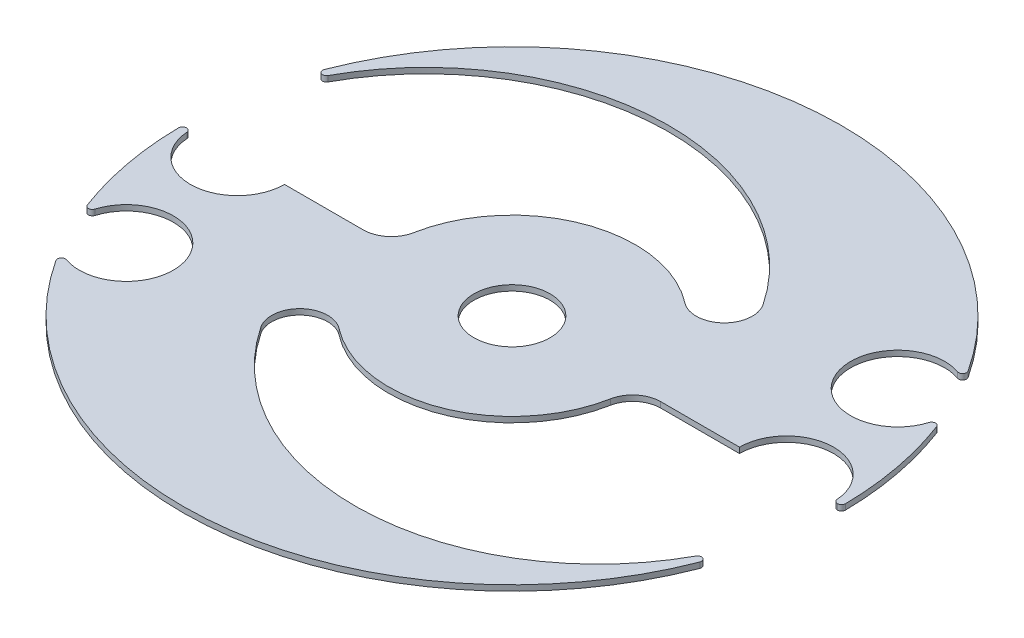
ISO-10303-21;
HEADER;
FILE_DESCRIPTION(('STEP AP214'),'2;1');
FILE_NAME('part.step','',(''),(''),'','','');
FILE_SCHEMA(('AUTOMOTIVE_DESIGN { 1 0 10303 214 1 1 1 1 }'));
ENDSEC;
DATA;
#1=APPLICATION_CONTEXT('core data for automotive mechanical design processes');
#2=APPLICATION_PROTOCOL_DEFINITION('international standard','automotive_design',2000,#1);
#3=PRODUCT_CONTEXT('',#1,'mechanical');
#4=PRODUCT('Part','Part','',(#3));
#5=PRODUCT_RELATED_PRODUCT_CATEGORY('part','',(#4));
#6=PRODUCT_DEFINITION_FORMATION('','',#4);
#7=PRODUCT_DEFINITION_CONTEXT('part definition',#1,'design');
#8=PRODUCT_DEFINITION('design','',#6,#7);
#9=PRODUCT_DEFINITION_SHAPE('','',#8);
#10=(LENGTH_UNIT() NAMED_UNIT(*) SI_UNIT(.MILLI.,.METRE.));
#11=(NAMED_UNIT(*) PLANE_ANGLE_UNIT() SI_UNIT($,.RADIAN.));
#12=(NAMED_UNIT(*) SI_UNIT($,.STERADIAN.) SOLID_ANGLE_UNIT());
#13=UNCERTAINTY_MEASURE_WITH_UNIT(LENGTH_MEASURE(1.E-05),#10,'distance_accuracy_value','');
#14=(GEOMETRIC_REPRESENTATION_CONTEXT(3) GLOBAL_UNCERTAINTY_ASSIGNED_CONTEXT((#13)) GLOBAL_UNIT_ASSIGNED_CONTEXT((#10,
#11,#12)) REPRESENTATION_CONTEXT('',''));
#15=CARTESIAN_POINT('',(0.,0.,0.));
#16=DIRECTION('',(0.,0.,1.));
#17=DIRECTION('',(1.,0.,0.));
#18=AXIS2_PLACEMENT_3D('',#15,#16,#17);
#19=CARTESIAN_POINT('',(16.5064935064935,1.,-21.3666953954065));
#20=DIRECTION('',(0.,-1.,0.));
#21=DIRECTION('',(0.,0.,-1.));
#22=AXIS2_PLACEMENT_3D('',#19,#20,#21);
#23=CYLINDRICAL_SURFACE('',#22,4.99999999999999);
#24=CARTESIAN_POINT('',(16.5064935064935,0.,-21.3666953954065));
#25=DIRECTION('',(0.,1.,0.));
#26=DIRECTION('',(0.,0.,1.));
#27=AXIS2_PLACEMENT_3D('',#24,#25,#26);
#28=CIRCLE('',#27,4.99999999999999);
#29=CARTESIAN_POINT('',(13.4497354497355,0.,-17.4098999518127));
#30=VERTEX_POINT('',#29);
#31=CARTESIAN_POINT('',(20.6609848484849,0.,-24.1488171916834));
#32=VERTEX_POINT('',#31);
#33=EDGE_CURVE('E277',#30,#32,#28,.T.);
#34=ORIENTED_EDGE('',*,*,#33,.F.);
#35=DIRECTION('',(0.,-1.,0.));
#36=VECTOR('',#35,1.);
#37=CARTESIAN_POINT('',(13.4497354497355,1.,-17.4098999518127));
#38=LINE('',#37,#36);
#39=CARTESIAN_POINT('',(13.4497354497355,1.,-17.4098999518127));
#40=VERTEX_POINT('',#39);
#41=EDGE_CURVE('E11',#40,#30,#38,.T.);
#42=ORIENTED_EDGE('',*,*,#41,.F.);
#43=CARTESIAN_POINT('',(16.5064935064935,1.,-21.3666953954065));
#44=DIRECTION('',(0.,1.,0.));
#45=DIRECTION('',(0.,0.,1.));
#46=AXIS2_PLACEMENT_3D('',#43,#44,#45);
#47=CIRCLE('',#46,4.99999999999999);
#48=CARTESIAN_POINT('',(20.6609848484849,1.,-24.1488171916834));
#49=VERTEX_POINT('',#48);
#50=EDGE_CURVE('E385',#40,#49,#47,.T.);
#51=ORIENTED_EDGE('',*,*,#50,.T.);
#52=DIRECTION('',(0.,-1.,0.));
#53=VECTOR('',#52,1.);
#54=CARTESIAN_POINT('',(20.6609848484849,1.,-24.1488171916834));
#55=LINE('',#54,#53);
#56=EDGE_CURVE('E160',#49,#32,#55,.T.);
#57=ORIENTED_EDGE('',*,*,#56,.T.);
#58=EDGE_LOOP('',(#34,#42,#51,#57));
#59=FACE_BOUND('',#58,.T.);
#60=ADVANCED_FACE('F39',(#59),#23,.F.);
#61=CARTESIAN_POINT('',(0.,1.,0.));
#62=DIRECTION('',(0.,-1.,0.));
#63=DIRECTION('',(0.,0.,-1.));
#64=AXIS2_PLACEMENT_3D('',#61,#62,#63);
#65=CYLINDRICAL_SURFACE('',#64,22.);
#66=CARTESIAN_POINT('',(0.,0.,0.));
#67=DIRECTION('',(0.,1.,0.));
#68=DIRECTION('',(0.,0.,1.));
#69=AXIS2_PLACEMENT_3D('',#66,#67,#68);
#70=CIRCLE('',#69,22.);
#71=CARTESIAN_POINT('',(-21.6194801149093,0.,-4.07407407407399));
#72=VERTEX_POINT('',#71);
#73=EDGE_CURVE('E151',#30,#72,#70,.T.);
#74=ORIENTED_EDGE('',*,*,#73,.T.);
#75=DIRECTION('',(0.,-1.,0.));
#76=VECTOR('',#75,1.);
#77=CARTESIAN_POINT('',(-21.6194801149093,1.,-4.07407407407399));
#78=LINE('',#77,#76);
#79=CARTESIAN_POINT('',(-21.6194801149093,1.,-4.07407407407399));
#80=VERTEX_POINT('',#79);
#81=EDGE_CURVE('E49',#80,#72,#78,.T.);
#82=ORIENTED_EDGE('',*,*,#81,.F.);
#83=CARTESIAN_POINT('',(0.,1.,0.));
#84=DIRECTION('',(0.,1.,0.));
#85=DIRECTION('',(0.,0.,1.));
#86=AXIS2_PLACEMENT_3D('',#83,#84,#85);
#87=CIRCLE('',#86,22.);
#88=EDGE_CURVE('E251',#40,#80,#87,.T.);
#89=ORIENTED_EDGE('',*,*,#88,.F.);
#90=ORIENTED_EDGE('',*,*,#41,.T.);
#91=EDGE_LOOP('',(#74,#82,#89,#90));
#92=FACE_BOUND('',#91,.T.);
#93=ADVANCED_FACE('F591',(#92),#65,.T.);
#94=CARTESIAN_POINT('',(-26.5329983228432,1.,-4.99999999999988));
#95=DIRECTION('',(0.,-1.,0.));
#96=DIRECTION('',(0.,0.,-1.));
#97=AXIS2_PLACEMENT_3D('',#94,#95,#96);
#98=CYLINDRICAL_SURFACE('',#97,5.);
#99=CARTESIAN_POINT('',(-26.5329983228432,0.,-4.99999999999988));
#100=DIRECTION('',(0.,-1.,0.));
#101=DIRECTION('',(0.,0.,-1.));
#102=AXIS2_PLACEMENT_3D('',#99,#100,#101);
#103=CIRCLE('',#102,5.);
#104=CARTESIAN_POINT('',(-26.5329983228433,0.,1.15359111152458E-13));
#105=VERTEX_POINT('',#104);
#106=EDGE_CURVE('E259',#72,#105,#103,.T.);
#107=ORIENTED_EDGE('',*,*,#106,.T.);
#108=DIRECTION('',(0.,-1.,0.));
#109=VECTOR('',#108,1.);
#110=CARTESIAN_POINT('',(-26.5329983228433,1.,1.15359111152458E-13));
#111=LINE('',#110,#109);
#112=CARTESIAN_POINT('',(-26.5329983228433,1.,1.15359111152458E-13));
#113=VERTEX_POINT('',#112);
#114=EDGE_CURVE('E256',#113,#105,#111,.T.);
#115=ORIENTED_EDGE('',*,*,#114,.F.);
#116=CARTESIAN_POINT('',(-26.5329983228432,1.,-4.99999999999988));
#117=DIRECTION('',(0.,-1.,0.));
#118=DIRECTION('',(0.,0.,-1.));
#119=AXIS2_PLACEMENT_3D('',#116,#117,#118);
#120=CIRCLE('',#119,5.);
#121=EDGE_CURVE('E243',#80,#113,#120,.T.);
#122=ORIENTED_EDGE('',*,*,#121,.F.);
#123=ORIENTED_EDGE('',*,*,#81,.T.);
#124=EDGE_LOOP('',(#107,#115,#122,#123));
#125=FACE_BOUND('',#124,.T.);
#126=ADVANCED_FACE('F257',(#125),#98,.F.);
#127=CARTESIAN_POINT('',(-40.6,1.,0.));
#128=DIRECTION('',(0.,0.,-1.));
#129=DIRECTION('',(-1.,0.,0.));
#130=AXIS2_PLACEMENT_3D('',#127,#128,#129);
#131=PLANE('',#130);
#132=DIRECTION('',(1.,0.,0.));
#133=VECTOR('',#132,1.);
#134=CARTESIAN_POINT('',(-40.6,0.,0.));
#135=LINE('',#134,#133);
#136=CARTESIAN_POINT('',(-40.6,0.,0.));
#137=VERTEX_POINT('',#136);
#138=EDGE_CURVE('E379',#137,#105,#135,.T.);
#139=ORIENTED_EDGE('',*,*,#138,.F.);
#140=DIRECTION('',(0.,-1.,0.));
#141=VECTOR('',#140,1.);
#142=CARTESIAN_POINT('',(-40.6,1.,0.));
#143=LINE('',#142,#141);
#144=CARTESIAN_POINT('',(-40.6,1.,0.));
#145=VERTEX_POINT('',#144);
#146=EDGE_CURVE('E264',#145,#137,#143,.T.);
#147=ORIENTED_EDGE('',*,*,#146,.F.);
#148=DIRECTION('',(1.,0.,0.));
#149=VECTOR('',#148,1.);
#150=CARTESIAN_POINT('',(-40.6,1.,0.));
#151=LINE('',#150,#149);
#152=EDGE_CURVE('E249',#145,#113,#151,.T.);
#153=ORIENTED_EDGE('',*,*,#152,.T.);
#154=ORIENTED_EDGE('',*,*,#114,.T.);
#155=EDGE_LOOP('',(#139,#147,#153,#154));
#156=FACE_BOUND('',#155,.T.);
#157=ADVANCED_FACE('F266',(#156),#131,.T.);
#158=CARTESIAN_POINT('',(-49.,1.,0.));
#159=DIRECTION('',(0.,-1.,0.));
#160=DIRECTION('',(0.,0.,-1.));
#161=AXIS2_PLACEMENT_3D('',#158,#159,#160);
#162=CYLINDRICAL_SURFACE('',#161,8.4);
#163=CARTESIAN_POINT('',(-49.,0.,0.));
#164=DIRECTION('',(0.,1.,0.));
#165=DIRECTION('',(0.,0.,1.));
#166=AXIS2_PLACEMENT_3D('',#163,#164,#165);
#167=CIRCLE('',#166,8.4);
#168=CARTESIAN_POINT('',(-57.375111056404,0.,0.646153846153846));
#169=VERTEX_POINT('',#168);
#170=EDGE_CURVE('E375',#169,#137,#167,.T.);
#171=ORIENTED_EDGE('',*,*,#170,.F.);
#172=DIRECTION('',(0.,-1.,0.));
#173=VECTOR('',#172,1.);
#174=CARTESIAN_POINT('',(-57.375111056404,1.,0.646153846153846));
#175=LINE('',#174,#173);
#176=CARTESIAN_POINT('',(-57.375111056404,1.,0.646153846153846));
#177=VERTEX_POINT('',#176);
#178=EDGE_CURVE('E391',#177,#169,#175,.T.);
#179=ORIENTED_EDGE('',*,*,#178,.F.);
#180=CARTESIAN_POINT('',(-49.,1.,0.));
#181=DIRECTION('',(0.,1.,0.));
#182=DIRECTION('',(0.,0.,1.));
#183=AXIS2_PLACEMENT_3D('',#180,#181,#182);
#184=CIRCLE('',#183,8.4);
#185=EDGE_CURVE('E268',#177,#145,#184,.T.);
#186=ORIENTED_EDGE('',*,*,#185,.T.);
#187=ORIENTED_EDGE('',*,*,#146,.T.);
#188=EDGE_LOOP('',(#171,#179,#186,#187));
#189=FACE_BOUND('',#188,.T.);
#190=ADVANCED_FACE('F479',(#189),#162,.F.);
#191=CARTESIAN_POINT('',(-58.073036977771,1.,0.7));
#192=DIRECTION('',(0.,-1.,0.));
#193=DIRECTION('',(0.,0.,-1.));
#194=AXIS2_PLACEMENT_3D('',#191,#192,#193);
#195=CYLINDRICAL_SURFACE('',#194,0.699999999999999);
#196=CARTESIAN_POINT('',(-58.073036977771,0.,0.7));
#197=DIRECTION('',(0.,-1.,0.));
#198=DIRECTION('',(0.,0.,-1.));
#199=AXIS2_PLACEMENT_3D('',#196,#197,#198);
#200=CIRCLE('',#199,0.699999999999999);
#201=CARTESIAN_POINT('',(-58.073036977771,0.,0.));
#202=VERTEX_POINT('',#201);
#203=EDGE_CURVE('E371',#202,#169,#200,.T.);
#204=ORIENTED_EDGE('',*,*,#203,.F.);
#205=DIRECTION('',(0.,-1.,0.));
#206=VECTOR('',#205,1.);
#207=CARTESIAN_POINT('',(-58.073036977771,1.,0.));
#208=LINE('',#207,#206);
#209=CARTESIAN_POINT('',(-58.073036977771,1.,0.));
#210=VERTEX_POINT('',#209);
#211=EDGE_CURVE('E394',#210,#202,#208,.T.);
#212=ORIENTED_EDGE('',*,*,#211,.F.);
#213=CARTESIAN_POINT('',(-58.073036977771,1.,0.7));
#214=DIRECTION('',(0.,-1.,0.));
#215=DIRECTION('',(0.,0.,-1.));
#216=AXIS2_PLACEMENT_3D('',#213,#214,#215);
#217=CIRCLE('',#216,0.699999999999999);
#218=EDGE_CURVE('E271',#210,#177,#217,.T.);
#219=ORIENTED_EDGE('',*,*,#218,.T.);
#220=ORIENTED_EDGE('',*,*,#178,.T.);
#221=EDGE_LOOP('',(#204,#212,#219,#220));
#222=FACE_BOUND('',#221,.T.);
#223=ADVANCED_FACE('F485',(#222),#195,.T.);
#224=CARTESIAN_POINT('',(-58.09578297949,1.,0.));
#225=DIRECTION('',(0.,0.,-1.));
#226=DIRECTION('',(-1.,0.,0.));
#227=AXIS2_PLACEMENT_3D('',#224,#225,#226);
#228=PLANE('',#227);
#229=DIRECTION('',(1.,0.,0.));
#230=VECTOR('',#229,1.);
#231=CARTESIAN_POINT('',(-58.09578297949,0.,0.));
#232=LINE('',#231,#230);
#233=CARTESIAN_POINT('',(-58.09578297949,0.,0.));
#234=VERTEX_POINT('',#233);
#235=EDGE_CURVE('E367',#234,#202,#232,.T.);
#236=ORIENTED_EDGE('',*,*,#235,.F.);
#237=DIRECTION('',(0.,-1.,0.));
#238=VECTOR('',#237,1.);
#239=CARTESIAN_POINT('',(-58.09578297949,1.,0.));
#240=LINE('',#239,#238);
#241=CARTESIAN_POINT('',(-58.09578297949,1.,0.));
#242=VERTEX_POINT('',#241);
#243=EDGE_CURVE('E397',#242,#234,#240,.T.);
#244=ORIENTED_EDGE('',*,*,#243,.F.);
#245=DIRECTION('',(1.,0.,0.));
#246=VECTOR('',#245,1.);
#247=CARTESIAN_POINT('',(-58.09578297949,1.,0.));
#248=LINE('',#247,#246);
#249=EDGE_CURVE('E487',#242,#210,#248,.T.);
#250=ORIENTED_EDGE('',*,*,#249,.T.);
#251=ORIENTED_EDGE('',*,*,#211,.T.);
#252=EDGE_LOOP('',(#236,#244,#250,#251));
#253=FACE_BOUND('',#252,.T.);
#254=ADVANCED_FACE('F607',(#253),#228,.T.);
#255=CARTESIAN_POINT('',(-58.09578297949,1.,0.7));
#256=DIRECTION('',(0.,-1.,0.));
#257=DIRECTION('',(0.,0.,-1.));
#258=AXIS2_PLACEMENT_3D('',#255,#256,#257);
#259=CYLINDRICAL_SURFACE('',#258,0.700000000000003);
#260=CARTESIAN_POINT('',(-58.09578297949,0.,0.7));
#261=DIRECTION('',(0.,1.,0.));
#262=DIRECTION('',(0.,0.,1.));
#263=AXIS2_PLACEMENT_3D('',#260,#261,#262);
#264=CIRCLE('',#263,0.700000000000003);
#265=CARTESIAN_POINT('',(-58.795732172014,0.,0.708433734939759));
#266=VERTEX_POINT('',#265);
#267=EDGE_CURVE('E364',#234,#266,#264,.T.);
#268=ORIENTED_EDGE('',*,*,#267,.T.);
#269=DIRECTION('',(0.,-1.,0.));
#270=VECTOR('',#269,1.);
#271=CARTESIAN_POINT('',(-58.795732172014,1.,0.708433734939759));
#272=LINE('',#271,#270);
#273=CARTESIAN_POINT('',(-58.795732172014,1.,0.708433734939759));
#274=VERTEX_POINT('',#273);
#275=EDGE_CURVE('E400',#274,#266,#272,.T.);
#276=ORIENTED_EDGE('',*,*,#275,.F.);
#277=CARTESIAN_POINT('',(-58.09578297949,1.,0.7));
#278=DIRECTION('',(0.,1.,0.));
#279=DIRECTION('',(0.,0.,1.));
#280=AXIS2_PLACEMENT_3D('',#277,#278,#279);
#281=CIRCLE('',#280,0.700000000000003);
#282=EDGE_CURVE('E489',#242,#274,#281,.T.);
#283=ORIENTED_EDGE('',*,*,#282,.F.);
#284=ORIENTED_EDGE('',*,*,#243,.T.);
#285=EDGE_LOOP('',(#268,#276,#283,#284));
#286=FACE_BOUND('',#285,.T.);
#287=ADVANCED_FACE('F610',(#286),#259,.T.);
#288=CARTESIAN_POINT('',(0.,1.,0.));
#289=DIRECTION('',(0.,-1.,0.));
#290=DIRECTION('',(0.,0.,-1.));
#291=AXIS2_PLACEMENT_3D('',#288,#289,#290);
#292=CYLINDRICAL_SURFACE('',#291,58.8);
#293=CARTESIAN_POINT('',(0.,0.,0.));
#294=DIRECTION('',(0.,1.,0.));
#295=DIRECTION('',(0.,0.,1.));
#296=AXIS2_PLACEMENT_3D('',#293,#294,#295);
#297=CIRCLE('',#296,58.8);
#298=CARTESIAN_POINT('',(-55.0170490105935,0.,20.7500438111816));
#299=VERTEX_POINT('',#298);
#300=EDGE_CURVE('E360',#266,#299,#297,.T.);
#301=ORIENTED_EDGE('',*,*,#300,.T.);
#302=DIRECTION('',(0.,-1.,0.));
#303=VECTOR('',#302,1.);
#304=CARTESIAN_POINT('',(-55.0170490105935,1.,20.7500438111816));
#305=LINE('',#304,#303);
#306=CARTESIAN_POINT('',(-55.0170490105935,1.,20.7500438111816));
#307=VERTEX_POINT('',#306);
#308=EDGE_CURVE('E404',#307,#299,#305,.T.);
#309=ORIENTED_EDGE('',*,*,#308,.F.);
#310=CARTESIAN_POINT('',(0.,1.,0.));
#311=DIRECTION('',(0.,1.,0.));
#312=DIRECTION('',(0.,0.,1.));
#313=AXIS2_PLACEMENT_3D('',#310,#311,#312);
#314=CIRCLE('',#313,58.8);
#315=EDGE_CURVE('E494',#274,#307,#314,.T.);
#316=ORIENTED_EDGE('',*,*,#315,.F.);
#317=ORIENTED_EDGE('',*,*,#275,.T.);
#318=EDGE_LOOP('',(#301,#309,#316,#317));
#319=FACE_BOUND('',#318,.T.);
#320=ADVANCED_FACE('F614',(#319),#292,.T.);
#321=CARTESIAN_POINT('',(-54.3620841414197,1.,20.5030194800961));
#322=DIRECTION('',(0.,-1.,0.));
#323=DIRECTION('',(0.,0.,-1.));
#324=AXIS2_PLACEMENT_3D('',#321,#322,#323);
#325=CYLINDRICAL_SURFACE('',#324,0.7);
#326=CARTESIAN_POINT('',(-54.3620841414197,0.,20.5030194800961));
#327=DIRECTION('',(0.,-1.,0.));
#328=DIRECTION('',(0.,0.,-1.));
#329=AXIS2_PLACEMENT_3D('',#326,#327,#328);
#330=CIRCLE('',#329,0.7);
#331=CARTESIAN_POINT('',(-53.6926956317557,0.,20.7077608367628));
#332=VERTEX_POINT('',#331);
#333=EDGE_CURVE('E356',#332,#299,#330,.T.);
#334=ORIENTED_EDGE('',*,*,#333,.F.);
#335=DIRECTION('',(0.,-1.,0.));
#336=VECTOR('',#335,1.);
#337=CARTESIAN_POINT('',(-53.6926956317557,1.,20.7077608367628));
#338=LINE('',#337,#336);
#339=CARTESIAN_POINT('',(-53.6926956317557,1.,20.7077608367628));
#340=VERTEX_POINT('',#339);
#341=EDGE_CURVE('E407',#340,#332,#338,.T.);
#342=ORIENTED_EDGE('',*,*,#341,.F.);
#343=CARTESIAN_POINT('',(-54.3620841414197,1.,20.5030194800961));
#344=DIRECTION('',(0.,-1.,0.));
#345=DIRECTION('',(0.,0.,-1.));
#346=AXIS2_PLACEMENT_3D('',#343,#344,#345);
#347=CIRCLE('',#346,0.7);
#348=EDGE_CURVE('E497',#340,#307,#347,.T.);
#349=ORIENTED_EDGE('',*,*,#348,.T.);
#350=ORIENTED_EDGE('',*,*,#308,.T.);
#351=EDGE_LOOP('',(#334,#342,#349,#350));
#352=FACE_BOUND('',#351,.T.);
#353=ADVANCED_FACE('F618',(#352),#325,.T.);
#354=CARTESIAN_POINT('',(-45.6600335157869,1.,23.1646571167633));
#355=DIRECTION('',(0.,-1.,0.));
#356=DIRECTION('',(0.,0.,-1.));
#357=AXIS2_PLACEMENT_3D('',#354,#355,#356);
#358=CYLINDRICAL_SURFACE('',#357,8.40000000000003);
#359=CARTESIAN_POINT('',(-45.6600335157869,0.,23.1646571167633));
#360=DIRECTION('',(0.,1.,0.));
#361=DIRECTION('',(0.,0.,1.));
#362=AXIS2_PLACEMENT_3D('',#359,#360,#361);
#363=CIRCLE('',#362,8.40000000000003);
#364=CARTESIAN_POINT('',(-48.4215514985397,0.,31.0977535129339));
#365=VERTEX_POINT('',#364);
#366=EDGE_CURVE('E352',#365,#332,#363,.T.);
#367=ORIENTED_EDGE('',*,*,#366,.F.);
#368=DIRECTION('',(0.,-1.,0.));
#369=VECTOR('',#368,1.);
#370=CARTESIAN_POINT('',(-48.4215514985397,1.,31.0977535129339));
#371=LINE('',#370,#369);
#372=CARTESIAN_POINT('',(-48.4215514985397,1.,31.0977535129339));
#373=VERTEX_POINT('',#372);
#374=EDGE_CURVE('E410',#373,#365,#371,.T.);
#375=ORIENTED_EDGE('',*,*,#374,.F.);
#376=CARTESIAN_POINT('',(-45.6600335157869,1.,23.1646571167633));
#377=DIRECTION('',(0.,1.,0.));
#378=DIRECTION('',(0.,0.,1.));
#379=AXIS2_PLACEMENT_3D('',#376,#377,#378);
#380=CIRCLE('',#379,8.40000000000003);
#381=EDGE_CURVE('E501',#373,#340,#380,.T.);
#382=ORIENTED_EDGE('',*,*,#381,.T.);
#383=ORIENTED_EDGE('',*,*,#341,.T.);
#384=EDGE_LOOP('',(#367,#375,#382,#383));
#385=FACE_BOUND('',#384,.T.);
#386=ADVANCED_FACE('F622',(#385),#358,.F.);
#387=CARTESIAN_POINT('',(-48.6516779971024,1.,31.7588448792814));
#388=DIRECTION('',(0.,-1.,0.));
#389=DIRECTION('',(0.,0.,-1.));
#390=AXIS2_PLACEMENT_3D('',#387,#388,#389);
#391=CYLINDRICAL_SURFACE('',#390,0.700000000000001);
#392=CARTESIAN_POINT('',(-48.6516779971024,0.,31.7588448792814));
#393=DIRECTION('',(0.,1.,0.));
#394=DIRECTION('',(0.,0.,1.));
#395=AXIS2_PLACEMENT_3D('',#392,#393,#394);
#396=CIRCLE('',#395,0.700000000000001);
#397=CARTESIAN_POINT('',(-49.2378427922482,0.,32.141481564574));
#398=VERTEX_POINT('',#397);
#399=EDGE_CURVE('E349',#365,#398,#396,.T.);
#400=ORIENTED_EDGE('',*,*,#399,.T.);
#401=DIRECTION('',(0.,-1.,0.));
#402=VECTOR('',#401,1.);
#403=CARTESIAN_POINT('',(-49.2378427922482,1.,32.141481564574));
#404=LINE('',#403,#402);
#405=CARTESIAN_POINT('',(-49.2378427922482,1.,32.141481564574));
#406=VERTEX_POINT('',#405);
#407=EDGE_CURVE('E413',#406,#398,#404,.T.);
#408=ORIENTED_EDGE('',*,*,#407,.F.);
#409=CARTESIAN_POINT('',(-48.6516779971024,1.,31.7588448792814));
#410=DIRECTION('',(0.,1.,0.));
#411=DIRECTION('',(0.,0.,1.));
#412=AXIS2_PLACEMENT_3D('',#409,#410,#411);
#413=CIRCLE('',#412,0.700000000000001);
#414=EDGE_CURVE('E505',#373,#406,#413,.T.);
#415=ORIENTED_EDGE('',*,*,#414,.F.);
#416=ORIENTED_EDGE('',*,*,#374,.T.);
#417=EDGE_LOOP('',(#400,#408,#415,#416));
#418=FACE_BOUND('',#417,.T.);
#419=ADVANCED_FACE('F626',(#418),#391,.T.);
#420=CARTESIAN_POINT('',(0.,1.,0.));
#421=DIRECTION('',(0.,-1.,0.));
#422=DIRECTION('',(0.,0.,-1.));
#423=AXIS2_PLACEMENT_3D('',#420,#421,#422);
#424=CYLINDRICAL_SURFACE('',#423,58.8);
#425=CARTESIAN_POINT('',(0.,0.,0.));
#426=DIRECTION('',(0.,1.,0.));
#427=DIRECTION('',(0.,0.,1.));
#428=AXIS2_PLACEMENT_3D('',#425,#426,#427);
#429=CIRCLE('',#428,58.8);
#430=CARTESIAN_POINT('',(54.8070098576123,0.,21.2986307181375));
#431=VERTEX_POINT('',#430);
#432=EDGE_CURVE('E346',#398,#431,#429,.T.);
#433=ORIENTED_EDGE('',*,*,#432,.T.);
#434=DIRECTION('',(0.,-1.,0.));
#435=VECTOR('',#434,1.);
#436=CARTESIAN_POINT('',(54.8070098576123,1.,21.2986307181375));
#437=LINE('',#436,#435);
#438=CARTESIAN_POINT('',(54.8070098576123,1.,21.2986307181375));
#439=VERTEX_POINT('',#438);
#440=EDGE_CURVE('E417',#439,#431,#437,.T.);
#441=ORIENTED_EDGE('',*,*,#440,.F.);
#442=CARTESIAN_POINT('',(0.,1.,0.));
#443=DIRECTION('',(0.,1.,0.));
#444=DIRECTION('',(0.,0.,1.));
#445=AXIS2_PLACEMENT_3D('',#442,#443,#444);
#446=CIRCLE('',#445,58.8);
#447=EDGE_CURVE('E508',#406,#439,#446,.T.);
#448=ORIENTED_EDGE('',*,*,#447,.F.);
#449=ORIENTED_EDGE('',*,*,#407,.T.);
#450=EDGE_LOOP('',(#433,#441,#448,#449));
#451=FACE_BOUND('',#450,.T.);
#452=ADVANCED_FACE('F630',(#451),#424,.T.);
#453=CARTESIAN_POINT('',(54.1545454545455,1.,21.0450755905407));
#454=DIRECTION('',(0.,-1.,0.));
#455=DIRECTION('',(0.,0.,-1.));
#456=AXIS2_PLACEMENT_3D('',#453,#454,#455);
#457=CYLINDRICAL_SURFACE('',#456,0.7);
#458=CARTESIAN_POINT('',(54.1545454545455,0.,21.0450755905407));
#459=DIRECTION('',(0.,1.,0.));
#460=DIRECTION('',(0.,0.,1.));
#461=AXIS2_PLACEMENT_3D('',#458,#459,#460);
#462=CIRCLE('',#461,0.7);
#463=CARTESIAN_POINT('',(53.539393939394,0.,20.7110267716432));
#464=VERTEX_POINT('',#463);
#465=EDGE_CURVE('E342',#431,#464,#462,.T.);
#466=ORIENTED_EDGE('',*,*,#465,.T.);
#467=DIRECTION('',(0.,-1.,0.));
#468=VECTOR('',#467,1.);
#469=CARTESIAN_POINT('',(53.539393939394,1.,20.7110267716432));
#470=LINE('',#469,#468);
#471=CARTESIAN_POINT('',(53.539393939394,1.,20.7110267716432));
#472=VERTEX_POINT('',#471);
#473=EDGE_CURVE('E421',#472,#464,#470,.T.);
#474=ORIENTED_EDGE('',*,*,#473,.F.);
#475=CARTESIAN_POINT('',(54.1545454545455,1.,21.0450755905407));
#476=DIRECTION('',(0.,1.,0.));
#477=DIRECTION('',(0.,0.,1.));
#478=AXIS2_PLACEMENT_3D('',#475,#476,#477);
#479=CIRCLE('',#478,0.7);
#480=EDGE_CURVE('E511',#439,#472,#479,.T.);
#481=ORIENTED_EDGE('',*,*,#480,.F.);
#482=ORIENTED_EDGE('',*,*,#440,.T.);
#483=EDGE_LOOP('',(#466,#474,#481,#482));
#484=FACE_BOUND('',#483,.T.);
#485=ADVANCED_FACE('F634',(#484),#457,.T.);
#486=CARTESIAN_POINT('',(15.4,1.,0.));
#487=DIRECTION('',(0.,-1.,0.));
#488=DIRECTION('',(0.,0.,-1.));
#489=AXIS2_PLACEMENT_3D('',#486,#487,#488);
#490=CYLINDRICAL_SURFACE('',#489,43.4);
#491=CARTESIAN_POINT('',(15.4,0.,0.));
#492=DIRECTION('',(0.,1.,0.));
#493=DIRECTION('',(0.,0.,1.));
#494=AXIS2_PLACEMENT_3D('',#491,#492,#493);
#495=CIRCLE('',#494,43.4);
#496=CARTESIAN_POINT('',(-20.6609848484849,0.,24.1488171916834));
#497=VERTEX_POINT('',#496);
#498=EDGE_CURVE('E338',#497,#464,#495,.T.);
#499=ORIENTED_EDGE('',*,*,#498,.F.);
#500=DIRECTION('',(0.,-1.,0.));
#501=VECTOR('',#500,1.);
#502=CARTESIAN_POINT('',(-20.6609848484849,1.,24.1488171916834));
#503=LINE('',#502,#501);
#504=CARTESIAN_POINT('',(-20.6609848484849,1.,24.1488171916834));
#505=VERTEX_POINT('',#504);
#506=EDGE_CURVE('E424',#505,#497,#503,.T.);
#507=ORIENTED_EDGE('',*,*,#506,.F.);
#508=CARTESIAN_POINT('',(15.4,1.,0.));
#509=DIRECTION('',(0.,1.,0.));
#510=DIRECTION('',(0.,0.,1.));
#511=AXIS2_PLACEMENT_3D('',#508,#509,#510);
#512=CIRCLE('',#511,43.4);
#513=EDGE_CURVE('E514',#505,#472,#512,.T.);
#514=ORIENTED_EDGE('',*,*,#513,.T.);
#515=ORIENTED_EDGE('',*,*,#473,.T.);
#516=EDGE_LOOP('',(#499,#507,#514,#515));
#517=FACE_BOUND('',#516,.T.);
#518=ADVANCED_FACE('F638',(#517),#490,.F.);
#519=CARTESIAN_POINT('',(-16.5064935064935,1.,21.3666953954065));
#520=DIRECTION('',(0.,-1.,0.));
#521=DIRECTION('',(0.,0.,-1.));
#522=AXIS2_PLACEMENT_3D('',#519,#520,#521);
#523=CYLINDRICAL_SURFACE('',#522,5.);
#524=CARTESIAN_POINT('',(-16.5064935064935,0.,21.3666953954065));
#525=DIRECTION('',(0.,-1.,0.));
#526=DIRECTION('',(0.,0.,-1.));
#527=AXIS2_PLACEMENT_3D('',#524,#525,#526);
#528=CIRCLE('',#527,5.);
#529=CARTESIAN_POINT('',(-13.4497354497355,0.,17.4098999518127));
#530=VERTEX_POINT('',#529);
#531=EDGE_CURVE('E334',#497,#530,#528,.T.);
#532=ORIENTED_EDGE('',*,*,#531,.T.);
#533=DIRECTION('',(0.,-1.,0.));
#534=VECTOR('',#533,1.);
#535=CARTESIAN_POINT('',(-13.4497354497355,1.,17.4098999518127));
#536=LINE('',#535,#534);
#537=CARTESIAN_POINT('',(-13.4497354497355,1.,17.4098999518127));
#538=VERTEX_POINT('',#537);
#539=EDGE_CURVE('E427',#538,#530,#536,.T.);
#540=ORIENTED_EDGE('',*,*,#539,.F.);
#541=CARTESIAN_POINT('',(-16.5064935064935,1.,21.3666953954065));
#542=DIRECTION('',(0.,-1.,0.));
#543=DIRECTION('',(0.,0.,-1.));
#544=AXIS2_PLACEMENT_3D('',#541,#542,#543);
#545=CIRCLE('',#544,5.);
#546=EDGE_CURVE('E518',#505,#538,#545,.T.);
#547=ORIENTED_EDGE('',*,*,#546,.F.);
#548=ORIENTED_EDGE('',*,*,#506,.T.);
#549=EDGE_LOOP('',(#532,#540,#547,#548));
#550=FACE_BOUND('',#549,.T.);
#551=ADVANCED_FACE('F642',(#550),#523,.F.);
#552=CARTESIAN_POINT('',(0.,1.,0.));
#553=DIRECTION('',(0.,-1.,0.));
#554=DIRECTION('',(0.,0.,-1.));
#555=AXIS2_PLACEMENT_3D('',#552,#553,#554);
#556=CYLINDRICAL_SURFACE('',#555,22.);
#557=CARTESIAN_POINT('',(0.,0.,0.));
#558=DIRECTION('',(0.,-1.,0.));
#559=DIRECTION('',(0.,0.,-1.));
#560=AXIS2_PLACEMENT_3D('',#557,#558,#559);
#561=CIRCLE('',#560,22.);
#562=CARTESIAN_POINT('',(21.6194801149093,0.,4.07407407407408));
#563=VERTEX_POINT('',#562);
#564=EDGE_CURVE('E330',#563,#530,#561,.T.);
#565=ORIENTED_EDGE('',*,*,#564,.F.);
#566=DIRECTION('',(0.,-1.,0.));
#567=VECTOR('',#566,1.);
#568=CARTESIAN_POINT('',(21.6194801149093,1.,4.07407407407408));
#569=LINE('',#568,#567);
#570=CARTESIAN_POINT('',(21.6194801149093,1.,4.07407407407408));
#571=VERTEX_POINT('',#570);
#572=EDGE_CURVE('E430',#571,#563,#569,.T.);
#573=ORIENTED_EDGE('',*,*,#572,.F.);
#574=CARTESIAN_POINT('',(0.,1.,0.));
#575=DIRECTION('',(0.,-1.,0.));
#576=DIRECTION('',(0.,0.,-1.));
#577=AXIS2_PLACEMENT_3D('',#574,#575,#576);
#578=CIRCLE('',#577,22.);
#579=EDGE_CURVE('E521',#571,#538,#578,.T.);
#580=ORIENTED_EDGE('',*,*,#579,.T.);
#581=ORIENTED_EDGE('',*,*,#539,.T.);
#582=EDGE_LOOP('',(#565,#573,#580,#581));
#583=FACE_BOUND('',#582,.T.);
#584=ADVANCED_FACE('F646',(#583),#556,.T.);
#585=CARTESIAN_POINT('',(26.5329983228432,1.,5.));
#586=DIRECTION('',(0.,-1.,0.));
#587=DIRECTION('',(0.,0.,-1.));
#588=AXIS2_PLACEMENT_3D('',#585,#586,#587);
#589=CYLINDRICAL_SURFACE('',#588,5.);
#590=CARTESIAN_POINT('',(26.5329983228432,0.,5.));
#591=DIRECTION('',(0.,1.,0.));
#592=DIRECTION('',(0.,0.,1.));
#593=AXIS2_PLACEMENT_3D('',#590,#591,#592);
#594=CIRCLE('',#593,5.);
#595=CARTESIAN_POINT('',(26.5329983228432,0.,0.));
#596=VERTEX_POINT('',#595);
#597=EDGE_CURVE('E326',#596,#563,#594,.T.);
#598=ORIENTED_EDGE('',*,*,#597,.F.);
#599=DIRECTION('',(0.,-1.,0.));
#600=VECTOR('',#599,1.);
#601=CARTESIAN_POINT('',(26.5329983228432,1.,0.));
#602=LINE('',#601,#600);
#603=CARTESIAN_POINT('',(26.5329983228432,1.,0.));
#604=VERTEX_POINT('',#603);
#605=EDGE_CURVE('E433',#604,#596,#602,.T.);
#606=ORIENTED_EDGE('',*,*,#605,.F.);
#607=CARTESIAN_POINT('',(26.5329983228432,1.,5.));
#608=DIRECTION('',(0.,1.,0.));
#609=DIRECTION('',(0.,0.,1.));
#610=AXIS2_PLACEMENT_3D('',#607,#608,#609);
#611=CIRCLE('',#610,5.);
#612=EDGE_CURVE('E525',#604,#571,#611,.T.);
#613=ORIENTED_EDGE('',*,*,#612,.T.);
#614=ORIENTED_EDGE('',*,*,#572,.T.);
#615=EDGE_LOOP('',(#598,#606,#613,#614));
#616=FACE_BOUND('',#615,.T.);
#617=ADVANCED_FACE('F650',(#616),#589,.F.);
#618=CARTESIAN_POINT('',(40.6,1.,0.));
#619=DIRECTION('',(0.,0.,1.));
#620=DIRECTION('',(1.,0.,0.));
#621=AXIS2_PLACEMENT_3D('',#618,#619,#620);
#622=PLANE('',#621);
#623=DIRECTION('',(-1.,0.,0.));
#624=VECTOR('',#623,1.);
#625=CARTESIAN_POINT('',(40.6,0.,0.));
#626=LINE('',#625,#624);
#627=CARTESIAN_POINT('',(40.6,0.,0.));
#628=VERTEX_POINT('',#627);
#629=EDGE_CURVE('E322',#628,#596,#626,.T.);
#630=ORIENTED_EDGE('',*,*,#629,.F.);
#631=DIRECTION('',(0.,-1.,0.));
#632=VECTOR('',#631,1.);
#633=CARTESIAN_POINT('',(40.6,1.,0.));
#634=LINE('',#633,#632);
#635=CARTESIAN_POINT('',(40.6,1.,0.));
#636=VERTEX_POINT('',#635);
#637=EDGE_CURVE('E436',#636,#628,#634,.T.);
#638=ORIENTED_EDGE('',*,*,#637,.F.);
#639=DIRECTION('',(-1.,0.,0.));
#640=VECTOR('',#639,1.);
#641=CARTESIAN_POINT('',(40.6,1.,0.));
#642=LINE('',#641,#640);
#643=EDGE_CURVE('E529',#636,#604,#642,.T.);
#644=ORIENTED_EDGE('',*,*,#643,.T.);
#645=ORIENTED_EDGE('',*,*,#605,.T.);
#646=EDGE_LOOP('',(#630,#638,#644,#645));
#647=FACE_BOUND('',#646,.T.);
#648=ADVANCED_FACE('F654',(#647),#622,.T.);
#649=CARTESIAN_POINT('',(49.,1.,0.));
#650=DIRECTION('',(0.,-1.,0.));
#651=DIRECTION('',(0.,0.,-1.));
#652=AXIS2_PLACEMENT_3D('',#649,#650,#651);
#653=CYLINDRICAL_SURFACE('',#652,8.4);
#654=CARTESIAN_POINT('',(49.,0.,0.));
#655=DIRECTION('',(0.,-1.,0.));
#656=DIRECTION('',(0.,0.,-1.));
#657=AXIS2_PLACEMENT_3D('',#654,#655,#656);
#658=CIRCLE('',#657,8.4);
#659=CARTESIAN_POINT('',(57.375111056404,0.,-0.646153846153848));
#660=VERTEX_POINT('',#659);
#661=EDGE_CURVE('E318',#628,#660,#658,.T.);
#662=ORIENTED_EDGE('',*,*,#661,.T.);
#663=DIRECTION('',(0.,-1.,0.));
#664=VECTOR('',#663,1.);
#665=CARTESIAN_POINT('',(57.375111056404,1.,-0.646153846153848));
#666=LINE('',#665,#664);
#667=CARTESIAN_POINT('',(57.375111056404,1.,-0.646153846153848));
#668=VERTEX_POINT('',#667);
#669=EDGE_CURVE('E439',#668,#660,#666,.T.);
#670=ORIENTED_EDGE('',*,*,#669,.F.);
#671=CARTESIAN_POINT('',(49.,1.,0.));
#672=DIRECTION('',(0.,-1.,0.));
#673=DIRECTION('',(0.,0.,-1.));
#674=AXIS2_PLACEMENT_3D('',#671,#672,#673);
#675=CIRCLE('',#674,8.4);
#676=EDGE_CURVE('E533',#636,#668,#675,.T.);
#677=ORIENTED_EDGE('',*,*,#676,.F.);
#678=ORIENTED_EDGE('',*,*,#637,.T.);
#679=EDGE_LOOP('',(#662,#670,#677,#678));
#680=FACE_BOUND('',#679,.T.);
#681=ADVANCED_FACE('F658',(#680),#653,.F.);
#682=CARTESIAN_POINT('',(58.073036977771,1.,-0.7));
#683=DIRECTION('',(0.,-1.,0.));
#684=DIRECTION('',(0.,0.,-1.));
#685=AXIS2_PLACEMENT_3D('',#682,#683,#684);
#686=CYLINDRICAL_SURFACE('',#685,0.699999999999999);
#687=CARTESIAN_POINT('',(58.073036977771,0.,-0.7));
#688=DIRECTION('',(0.,-1.,0.));
#689=DIRECTION('',(0.,0.,-1.));
#690=AXIS2_PLACEMENT_3D('',#687,#688,#689);
#691=CIRCLE('',#690,0.699999999999999);
#692=CARTESIAN_POINT('',(58.073036977771,0.,0.));
#693=VERTEX_POINT('',#692);
#694=EDGE_CURVE('E314',#693,#660,#691,.T.);
#695=ORIENTED_EDGE('',*,*,#694,.F.);
#696=DIRECTION('',(0.,-1.,0.));
#697=VECTOR('',#696,1.);
#698=CARTESIAN_POINT('',(58.073036977771,1.,0.));
#699=LINE('',#698,#697);
#700=CARTESIAN_POINT('',(58.073036977771,1.,0.));
#701=VERTEX_POINT('',#700);
#702=EDGE_CURVE('E442',#701,#693,#699,.T.);
#703=ORIENTED_EDGE('',*,*,#702,.F.);
#704=CARTESIAN_POINT('',(58.073036977771,1.,-0.7));
#705=DIRECTION('',(0.,-1.,0.));
#706=DIRECTION('',(0.,0.,-1.));
#707=AXIS2_PLACEMENT_3D('',#704,#705,#706);
#708=CIRCLE('',#707,0.699999999999999);
#709=EDGE_CURVE('E536',#701,#668,#708,.T.);
#710=ORIENTED_EDGE('',*,*,#709,.T.);
#711=ORIENTED_EDGE('',*,*,#669,.T.);
#712=EDGE_LOOP('',(#695,#703,#710,#711));
#713=FACE_BOUND('',#712,.T.);
#714=ADVANCED_FACE('F662',(#713),#686,.T.);
#715=CARTESIAN_POINT('',(58.073036977771,1.,0.));
#716=DIRECTION('',(0.,0.,-1.));
#717=DIRECTION('',(-1.,0.,0.));
#718=AXIS2_PLACEMENT_3D('',#715,#716,#717);
#719=PLANE('',#718);
#720=DIRECTION('',(1.,0.,0.));
#721=VECTOR('',#720,1.);
#722=CARTESIAN_POINT('',(58.073036977771,0.,0.));
#723=LINE('',#722,#721);
#724=CARTESIAN_POINT('',(58.09578297949,0.,0.));
#725=VERTEX_POINT('',#724);
#726=EDGE_CURVE('E311',#693,#725,#723,.T.);
#727=ORIENTED_EDGE('',*,*,#726,.T.);
#728=DIRECTION('',(0.,-1.,0.));
#729=VECTOR('',#728,1.);
#730=CARTESIAN_POINT('',(58.09578297949,1.,0.));
#731=LINE('',#730,#729);
#732=CARTESIAN_POINT('',(58.09578297949,1.,0.));
#733=VERTEX_POINT('',#732);
#734=EDGE_CURVE('E445',#733,#725,#731,.T.);
#735=ORIENTED_EDGE('',*,*,#734,.F.);
#736=DIRECTION('',(1.,0.,0.));
#737=VECTOR('',#736,1.);
#738=CARTESIAN_POINT('',(58.073036977771,1.,0.));
#739=LINE('',#738,#737);
#740=EDGE_CURVE('E540',#701,#733,#739,.T.);
#741=ORIENTED_EDGE('',*,*,#740,.F.);
#742=ORIENTED_EDGE('',*,*,#702,.T.);
#743=EDGE_LOOP('',(#727,#735,#741,#742));
#744=FACE_BOUND('',#743,.T.);
#745=ADVANCED_FACE('F666',(#744),#719,.F.);
#746=CARTESIAN_POINT('',(58.09578297949,1.,-0.7));
#747=DIRECTION('',(0.,-1.,0.));
#748=DIRECTION('',(0.,0.,-1.));
#749=AXIS2_PLACEMENT_3D('',#746,#747,#748);
#750=CYLINDRICAL_SURFACE('',#749,0.700000000000006);
#751=CARTESIAN_POINT('',(58.09578297949,0.,-0.7));
#752=DIRECTION('',(0.,1.,0.));
#753=DIRECTION('',(0.,0.,1.));
#754=AXIS2_PLACEMENT_3D('',#751,#752,#753);
#755=CIRCLE('',#754,0.700000000000006);
#756=CARTESIAN_POINT('',(58.795732172014,0.,-0.708433734939759));
#757=VERTEX_POINT('',#756);
#758=EDGE_CURVE('E308',#725,#757,#755,.T.);
#759=ORIENTED_EDGE('',*,*,#758,.T.);
#760=DIRECTION('',(0.,-1.,0.));
#761=VECTOR('',#760,1.);
#762=CARTESIAN_POINT('',(58.795732172014,1.,-0.708433734939759));
#763=LINE('',#762,#761);
#764=CARTESIAN_POINT('',(58.795732172014,1.,-0.708433734939759));
#765=VERTEX_POINT('',#764);
#766=EDGE_CURVE('E449',#765,#757,#763,.T.);
#767=ORIENTED_EDGE('',*,*,#766,.F.);
#768=CARTESIAN_POINT('',(58.09578297949,1.,-0.7));
#769=DIRECTION('',(0.,1.,0.));
#770=DIRECTION('',(0.,0.,1.));
#771=AXIS2_PLACEMENT_3D('',#768,#769,#770);
#772=CIRCLE('',#771,0.700000000000006);
#773=EDGE_CURVE('E543',#733,#765,#772,.T.);
#774=ORIENTED_EDGE('',*,*,#773,.F.);
#775=ORIENTED_EDGE('',*,*,#734,.T.);
#776=EDGE_LOOP('',(#759,#767,#774,#775));
#777=FACE_BOUND('',#776,.T.);
#778=ADVANCED_FACE('F670',(#777),#750,.T.);
#779=CARTESIAN_POINT('',(0.,1.,0.));
#780=DIRECTION('',(0.,-1.,0.));
#781=DIRECTION('',(0.,0.,-1.));
#782=AXIS2_PLACEMENT_3D('',#779,#780,#781);
#783=CYLINDRICAL_SURFACE('',#782,58.8);
#784=CARTESIAN_POINT('',(0.,0.,0.));
#785=DIRECTION('',(0.,1.,0.));
#786=DIRECTION('',(0.,0.,1.));
#787=AXIS2_PLACEMENT_3D('',#784,#785,#786);
#788=CIRCLE('',#787,58.8);
#789=CARTESIAN_POINT('',(55.0170490105935,0.,-20.7500438111815));
#790=VERTEX_POINT('',#789);
#791=EDGE_CURVE('E305',#757,#790,#788,.T.);
#792=ORIENTED_EDGE('',*,*,#791,.T.);
#793=DIRECTION('',(0.,-1.,0.));
#794=VECTOR('',#793,1.);
#795=CARTESIAN_POINT('',(55.0170490105935,1.,-20.7500438111815));
#796=LINE('',#795,#794);
#797=CARTESIAN_POINT('',(55.0170490105935,1.,-20.7500438111815));
#798=VERTEX_POINT('',#797);
#799=EDGE_CURVE('E453',#798,#790,#796,.T.);
#800=ORIENTED_EDGE('',*,*,#799,.F.);
#801=CARTESIAN_POINT('',(0.,1.,0.));
#802=DIRECTION('',(0.,1.,0.));
#803=DIRECTION('',(0.,0.,1.));
#804=AXIS2_PLACEMENT_3D('',#801,#802,#803);
#805=CIRCLE('',#804,58.8);
#806=EDGE_CURVE('E546',#765,#798,#805,.T.);
#807=ORIENTED_EDGE('',*,*,#806,.F.);
#808=ORIENTED_EDGE('',*,*,#766,.T.);
#809=EDGE_LOOP('',(#792,#800,#807,#808));
#810=FACE_BOUND('',#809,.T.);
#811=ADVANCED_FACE('F674',(#810),#783,.T.);
#812=CARTESIAN_POINT('',(54.3620841414198,1.,-20.503019480096));
#813=DIRECTION('',(0.,-1.,0.));
#814=DIRECTION('',(0.,0.,-1.));
#815=AXIS2_PLACEMENT_3D('',#812,#813,#814);
#816=CYLINDRICAL_SURFACE('',#815,0.700000000000001);
#817=CARTESIAN_POINT('',(54.3620841414198,0.,-20.503019480096));
#818=DIRECTION('',(0.,1.,0.));
#819=DIRECTION('',(0.,0.,1.));
#820=AXIS2_PLACEMENT_3D('',#817,#818,#819);
#821=CIRCLE('',#820,0.700000000000001);
#822=CARTESIAN_POINT('',(53.6926956317557,0.,-20.7077608367628));
#823=VERTEX_POINT('',#822);
#824=EDGE_CURVE('E301',#790,#823,#821,.T.);
#825=ORIENTED_EDGE('',*,*,#824,.T.);
#826=DIRECTION('',(0.,-1.,0.));
#827=VECTOR('',#826,1.);
#828=CARTESIAN_POINT('',(53.6926956317557,1.,-20.7077608367628));
#829=LINE('',#828,#827);
#830=CARTESIAN_POINT('',(53.6926956317557,1.,-20.7077608367628));
#831=VERTEX_POINT('',#830);
#832=EDGE_CURVE('E457',#831,#823,#829,.T.);
#833=ORIENTED_EDGE('',*,*,#832,.F.);
#834=CARTESIAN_POINT('',(54.3620841414198,1.,-20.503019480096));
#835=DIRECTION('',(0.,1.,0.));
#836=DIRECTION('',(0.,0.,1.));
#837=AXIS2_PLACEMENT_3D('',#834,#835,#836);
#838=CIRCLE('',#837,0.700000000000001);
#839=EDGE_CURVE('E549',#798,#831,#838,.T.);
#840=ORIENTED_EDGE('',*,*,#839,.F.);
#841=ORIENTED_EDGE('',*,*,#799,.T.);
#842=EDGE_LOOP('',(#825,#833,#840,#841));
#843=FACE_BOUND('',#842,.T.);
#844=ADVANCED_FACE('F678',(#843),#816,.T.);
#845=CARTESIAN_POINT('',(45.6600335157869,1.,-23.1646571167633));
#846=DIRECTION('',(0.,-1.,0.));
#847=DIRECTION('',(0.,0.,-1.));
#848=AXIS2_PLACEMENT_3D('',#845,#846,#847);
#849=CYLINDRICAL_SURFACE('',#848,8.40000000000004);
#850=CARTESIAN_POINT('',(45.6600335157869,0.,-23.1646571167633));
#851=DIRECTION('',(0.,1.,0.));
#852=DIRECTION('',(0.,0.,1.));
#853=AXIS2_PLACEMENT_3D('',#850,#851,#852);
#854=CIRCLE('',#853,8.40000000000004);
#855=CARTESIAN_POINT('',(48.4215514985397,0.,-31.0977535129338));
#856=VERTEX_POINT('',#855);
#857=EDGE_CURVE('E297',#856,#823,#854,.T.);
#858=ORIENTED_EDGE('',*,*,#857,.F.);
#859=DIRECTION('',(0.,-1.,0.));
#860=VECTOR('',#859,1.);
#861=CARTESIAN_POINT('',(48.4215514985397,1.,-31.0977535129338));
#862=LINE('',#861,#860);
#863=CARTESIAN_POINT('',(48.4215514985397,1.,-31.0977535129338));
#864=VERTEX_POINT('',#863);
#865=EDGE_CURVE('E460',#864,#856,#862,.T.);
#866=ORIENTED_EDGE('',*,*,#865,.F.);
#867=CARTESIAN_POINT('',(45.6600335157869,1.,-23.1646571167633));
#868=DIRECTION('',(0.,1.,0.));
#869=DIRECTION('',(0.,0.,1.));
#870=AXIS2_PLACEMENT_3D('',#867,#868,#869);
#871=CIRCLE('',#870,8.40000000000004);
#872=EDGE_CURVE('E552',#864,#831,#871,.T.);
#873=ORIENTED_EDGE('',*,*,#872,.T.);
#874=ORIENTED_EDGE('',*,*,#832,.T.);
#875=EDGE_LOOP('',(#858,#866,#873,#874));
#876=FACE_BOUND('',#875,.T.);
#877=ADVANCED_FACE('F682',(#876),#849,.F.);
#878=CARTESIAN_POINT('',(48.6516779971024,1.,-31.7588448792814));
#879=DIRECTION('',(0.,-1.,0.));
#880=DIRECTION('',(0.,0.,-1.));
#881=AXIS2_PLACEMENT_3D('',#878,#879,#880);
#882=CYLINDRICAL_SURFACE('',#881,0.699999999999999);
#883=CARTESIAN_POINT('',(48.6516779971024,0.,-31.7588448792814));
#884=DIRECTION('',(0.,-1.,0.));
#885=DIRECTION('',(0.,0.,-1.));
#886=AXIS2_PLACEMENT_3D('',#883,#884,#885);
#887=CIRCLE('',#886,0.699999999999999);
#888=CARTESIAN_POINT('',(49.2378427922482,0.,-32.1414815645739));
#889=VERTEX_POINT('',#888);
#890=EDGE_CURVE('E293',#889,#856,#887,.T.);
#891=ORIENTED_EDGE('',*,*,#890,.F.);
#892=DIRECTION('',(0.,-1.,0.));
#893=VECTOR('',#892,1.);
#894=CARTESIAN_POINT('',(49.2378427922482,1.,-32.1414815645739));
#895=LINE('',#894,#893);
#896=CARTESIAN_POINT('',(49.2378427922482,1.,-32.1414815645739));
#897=VERTEX_POINT('',#896);
#898=EDGE_CURVE('E463',#897,#889,#895,.T.);
#899=ORIENTED_EDGE('',*,*,#898,.F.);
#900=CARTESIAN_POINT('',(48.6516779971024,1.,-31.7588448792814));
#901=DIRECTION('',(0.,-1.,0.));
#902=DIRECTION('',(0.,0.,-1.));
#903=AXIS2_PLACEMENT_3D('',#900,#901,#902);
#904=CIRCLE('',#903,0.699999999999999);
#905=EDGE_CURVE('E556',#897,#864,#904,.T.);
#906=ORIENTED_EDGE('',*,*,#905,.T.);
#907=ORIENTED_EDGE('',*,*,#865,.T.);
#908=EDGE_LOOP('',(#891,#899,#906,#907));
#909=FACE_BOUND('',#908,.T.);
#910=ADVANCED_FACE('F686',(#909),#882,.T.);
#911=CARTESIAN_POINT('',(0.,1.,0.));
#912=DIRECTION('',(0.,-1.,0.));
#913=DIRECTION('',(0.,0.,-1.));
#914=AXIS2_PLACEMENT_3D('',#911,#912,#913);
#915=CYLINDRICAL_SURFACE('',#914,58.8);
#916=CARTESIAN_POINT('',(0.,0.,0.));
#917=DIRECTION('',(0.,1.,0.));
#918=DIRECTION('',(0.,0.,1.));
#919=AXIS2_PLACEMENT_3D('',#916,#917,#918);
#920=CIRCLE('',#919,58.8);
#921=CARTESIAN_POINT('',(-54.8070098576122,0.,-21.2986307181375));
#922=VERTEX_POINT('',#921);
#923=EDGE_CURVE('E289',#889,#922,#920,.T.);
#924=ORIENTED_EDGE('',*,*,#923,.T.);
#925=DIRECTION('',(0.,-1.,0.));
#926=VECTOR('',#925,1.);
#927=CARTESIAN_POINT('',(-54.8070098576122,1.,-21.2986307181375));
#928=LINE('',#927,#926);
#929=CARTESIAN_POINT('',(-54.8070098576122,1.,-21.2986307181375));
#930=VERTEX_POINT('',#929);
#931=EDGE_CURVE('E466',#930,#922,#928,.T.);
#932=ORIENTED_EDGE('',*,*,#931,.F.);
#933=CARTESIAN_POINT('',(0.,1.,0.));
#934=DIRECTION('',(0.,1.,0.));
#935=DIRECTION('',(0.,0.,1.));
#936=AXIS2_PLACEMENT_3D('',#933,#934,#935);
#937=CIRCLE('',#936,58.8);
#938=EDGE_CURVE('E560',#897,#930,#937,.T.);
#939=ORIENTED_EDGE('',*,*,#938,.F.);
#940=ORIENTED_EDGE('',*,*,#898,.T.);
#941=EDGE_LOOP('',(#924,#932,#939,#940));
#942=FACE_BOUND('',#941,.T.);
#943=ADVANCED_FACE('F690',(#942),#915,.T.);
#944=CARTESIAN_POINT('',(-54.1545454545454,1.,-21.0450755905407));
#945=DIRECTION('',(0.,-1.,0.));
#946=DIRECTION('',(0.,0.,-1.));
#947=AXIS2_PLACEMENT_3D('',#944,#945,#946);
#948=CYLINDRICAL_SURFACE('',#947,0.7);
#949=CARTESIAN_POINT('',(-54.1545454545454,0.,-21.0450755905407));
#950=DIRECTION('',(0.,-1.,0.));
#951=DIRECTION('',(0.,0.,-1.));
#952=AXIS2_PLACEMENT_3D('',#949,#950,#951);
#953=CIRCLE('',#952,0.7);
#954=CARTESIAN_POINT('',(-53.5393939393939,0.,-20.7110267716432));
#955=VERTEX_POINT('',#954);
#956=EDGE_CURVE('E285',#955,#922,#953,.T.);
#957=ORIENTED_EDGE('',*,*,#956,.F.);
#958=DIRECTION('',(0.,-1.,0.));
#959=VECTOR('',#958,1.);
#960=CARTESIAN_POINT('',(-53.5393939393939,1.,-20.7110267716432));
#961=LINE('',#960,#959);
#962=CARTESIAN_POINT('',(-53.5393939393939,1.,-20.7110267716432));
#963=VERTEX_POINT('',#962);
#964=EDGE_CURVE('E469',#963,#955,#961,.T.);
#965=ORIENTED_EDGE('',*,*,#964,.F.);
#966=CARTESIAN_POINT('',(-54.1545454545454,1.,-21.0450755905407));
#967=DIRECTION('',(0.,-1.,0.));
#968=DIRECTION('',(0.,0.,-1.));
#969=AXIS2_PLACEMENT_3D('',#966,#967,#968);
#970=CIRCLE('',#969,0.7);
#971=EDGE_CURVE('E563',#963,#930,#970,.T.);
#972=ORIENTED_EDGE('',*,*,#971,.T.);
#973=ORIENTED_EDGE('',*,*,#931,.T.);
#974=EDGE_LOOP('',(#957,#965,#972,#973));
#975=FACE_BOUND('',#974,.T.);
#976=ADVANCED_FACE('F694',(#975),#948,.T.);
#977=CARTESIAN_POINT('',(-15.4,1.,0.));
#978=DIRECTION('',(0.,-1.,0.));
#979=DIRECTION('',(0.,0.,-1.));
#980=AXIS2_PLACEMENT_3D('',#977,#978,#979);
#981=CYLINDRICAL_SURFACE('',#980,43.4);
#982=CARTESIAN_POINT('',(-15.4,0.,0.));
#983=DIRECTION('',(0.,1.,0.));
#984=DIRECTION('',(0.,0.,1.));
#985=AXIS2_PLACEMENT_3D('',#982,#983,#984);
#986=CIRCLE('',#985,43.4);
#987=EDGE_CURVE('E281',#32,#955,#986,.T.);
#988=ORIENTED_EDGE('',*,*,#987,.F.);
#989=ORIENTED_EDGE('',*,*,#56,.F.);
#990=CARTESIAN_POINT('',(-15.4,1.,0.));
#991=DIRECTION('',(0.,1.,0.));
#992=DIRECTION('',(0.,0.,1.));
#993=AXIS2_PLACEMENT_3D('',#990,#991,#992);
#994=CIRCLE('',#993,43.4);
#995=EDGE_CURVE('E567',#49,#963,#994,.T.);
#996=ORIENTED_EDGE('',*,*,#995,.T.);
#997=ORIENTED_EDGE('',*,*,#964,.T.);
#998=EDGE_LOOP('',(#988,#989,#996,#997));
#999=FACE_BOUND('',#998,.T.);
#1000=ADVANCED_FACE('F472',(#999),#981,.F.);
#1001=CARTESIAN_POINT('',(16.5064935064935,1.,-21.3666953954065));
#1002=DIRECTION('',(0.,1.,0.));
#1003=DIRECTION('',(0.,0.,1.));
#1004=AXIS2_PLACEMENT_3D('',#1001,#1002,#1003);
#1005=PLANE('',#1004);
#1006=CARTESIAN_POINT('',(0.,1.,0.));
#1007=DIRECTION('',(0.,1.,0.));
#1008=DIRECTION('',(0.,0.,1.));
#1009=AXIS2_PLACEMENT_3D('',#1006,#1007,#1008);
#1010=CIRCLE('',#1009,6.8);
#1011=CARTESIAN_POINT('',(0.,1.,6.8));
#1012=VERTEX_POINT('',#1011);
#1013=EDGE_CURVE('E572',#1012,#1012,#1010,.T.);
#1014=ORIENTED_EDGE('',*,*,#1013,.F.);
#1015=EDGE_LOOP('',(#1014));
#1016=FACE_BOUND('',#1015,.T.);
#1017=ORIENTED_EDGE('',*,*,#50,.F.);
#1018=ORIENTED_EDGE('',*,*,#88,.T.);
#1019=ORIENTED_EDGE('',*,*,#121,.T.);
#1020=ORIENTED_EDGE('',*,*,#152,.F.);
#1021=ORIENTED_EDGE('',*,*,#185,.F.);
#1022=ORIENTED_EDGE('',*,*,#218,.F.);
#1023=ORIENTED_EDGE('',*,*,#249,.F.);
#1024=ORIENTED_EDGE('',*,*,#282,.T.);
#1025=ORIENTED_EDGE('',*,*,#315,.T.);
#1026=ORIENTED_EDGE('',*,*,#348,.F.);
#1027=ORIENTED_EDGE('',*,*,#381,.F.);
#1028=ORIENTED_EDGE('',*,*,#414,.T.);
#1029=ORIENTED_EDGE('',*,*,#447,.T.);
#1030=ORIENTED_EDGE('',*,*,#480,.T.);
#1031=ORIENTED_EDGE('',*,*,#513,.F.);
#1032=ORIENTED_EDGE('',*,*,#546,.T.);
#1033=ORIENTED_EDGE('',*,*,#579,.F.);
#1034=ORIENTED_EDGE('',*,*,#612,.F.);
#1035=ORIENTED_EDGE('',*,*,#643,.F.);
#1036=ORIENTED_EDGE('',*,*,#676,.T.);
#1037=ORIENTED_EDGE('',*,*,#709,.F.);
#1038=ORIENTED_EDGE('',*,*,#740,.T.);
#1039=ORIENTED_EDGE('',*,*,#773,.T.);
#1040=ORIENTED_EDGE('',*,*,#806,.T.);
#1041=ORIENTED_EDGE('',*,*,#839,.T.);
#1042=ORIENTED_EDGE('',*,*,#872,.F.);
#1043=ORIENTED_EDGE('',*,*,#905,.F.);
#1044=ORIENTED_EDGE('',*,*,#938,.T.);
#1045=ORIENTED_EDGE('',*,*,#971,.F.);
#1046=ORIENTED_EDGE('',*,*,#995,.F.);
#1047=EDGE_LOOP('',(#1017,#1018,#1019,#1020,#1021,#1022,#1023,#1024,#1025,#1026,#1027,#1028,
#1029,#1030,#1031,#1032,#1033,#1034,#1035,#1036,#1037,#1038,#1039,#1040,#1041,#1042,#1043,#1044,
#1045,#1046));
#1048=FACE_BOUND('',#1047,.T.);
#1049=ADVANCED_FACE('F246',(#1016,#1048),#1005,.T.);
#1050=CARTESIAN_POINT('',(16.5064935064935,0.,-21.3666953954065));
#1051=DIRECTION('',(0.,1.,0.));
#1052=DIRECTION('',(0.,0.,1.));
#1053=AXIS2_PLACEMENT_3D('',#1050,#1051,#1052);
#1054=PLANE('',#1053);
#1055=CARTESIAN_POINT('',(0.,0.,0.));
#1056=DIRECTION('',(0.,1.,0.));
#1057=DIRECTION('',(0.,0.,1.));
#1058=AXIS2_PLACEMENT_3D('',#1055,#1056,#1057);
#1059=CIRCLE('',#1058,6.8);
#1060=CARTESIAN_POINT('',(0.,0.,6.8));
#1061=VERTEX_POINT('',#1060);
#1062=EDGE_CURVE('E42',#1061,#1061,#1059,.T.);
#1063=ORIENTED_EDGE('',*,*,#1062,.T.);
#1064=EDGE_LOOP('',(#1063));
#1065=FACE_BOUND('',#1064,.T.);
#1066=ORIENTED_EDGE('',*,*,#33,.T.);
#1067=ORIENTED_EDGE('',*,*,#987,.T.);
#1068=ORIENTED_EDGE('',*,*,#956,.T.);
#1069=ORIENTED_EDGE('',*,*,#923,.F.);
#1070=ORIENTED_EDGE('',*,*,#890,.T.);
#1071=ORIENTED_EDGE('',*,*,#857,.T.);
#1072=ORIENTED_EDGE('',*,*,#824,.F.);
#1073=ORIENTED_EDGE('',*,*,#791,.F.);
#1074=ORIENTED_EDGE('',*,*,#758,.F.);
#1075=ORIENTED_EDGE('',*,*,#726,.F.);
#1076=ORIENTED_EDGE('',*,*,#694,.T.);
#1077=ORIENTED_EDGE('',*,*,#661,.F.);
#1078=ORIENTED_EDGE('',*,*,#629,.T.);
#1079=ORIENTED_EDGE('',*,*,#597,.T.);
#1080=ORIENTED_EDGE('',*,*,#564,.T.);
#1081=ORIENTED_EDGE('',*,*,#531,.F.);
#1082=ORIENTED_EDGE('',*,*,#498,.T.);
#1083=ORIENTED_EDGE('',*,*,#465,.F.);
#1084=ORIENTED_EDGE('',*,*,#432,.F.);
#1085=ORIENTED_EDGE('',*,*,#399,.F.);
#1086=ORIENTED_EDGE('',*,*,#366,.T.);
#1087=ORIENTED_EDGE('',*,*,#333,.T.);
#1088=ORIENTED_EDGE('',*,*,#300,.F.);
#1089=ORIENTED_EDGE('',*,*,#267,.F.);
#1090=ORIENTED_EDGE('',*,*,#235,.T.);
#1091=ORIENTED_EDGE('',*,*,#203,.T.);
#1092=ORIENTED_EDGE('',*,*,#170,.T.);
#1093=ORIENTED_EDGE('',*,*,#138,.T.);
#1094=ORIENTED_EDGE('',*,*,#106,.F.);
#1095=ORIENTED_EDGE('',*,*,#73,.F.);
#1096=EDGE_LOOP('',(#1066,#1067,#1068,#1069,#1070,#1071,#1072,#1073,#1074,#1075,#1076,#1077,
#1078,#1079,#1080,#1081,#1082,#1083,#1084,#1085,#1086,#1087,#1088,#1089,#1090,#1091,#1092,#1093,
#1094,#1095));
#1097=FACE_BOUND('',#1096,.T.);
#1098=ADVANCED_FACE('F475',(#1065,#1097),#1054,.F.);
#1099=CARTESIAN_POINT('',(0.,-9.,0.));
#1100=DIRECTION('',(0.,1.,0.));
#1101=DIRECTION('',(0.,0.,1.));
#1102=AXIS2_PLACEMENT_3D('',#1099,#1100,#1101);
#1103=CYLINDRICAL_SURFACE('',#1102,6.8);
#1104=ORIENTED_EDGE('',*,*,#1013,.T.);
#1105=EDGE_LOOP('',(#1104));
#1106=FACE_BOUND('',#1105,.T.);
#1107=ORIENTED_EDGE('',*,*,#1062,.F.);
#1108=EDGE_LOOP('',(#1107));
#1109=FACE_BOUND('',#1108,.T.);
#1110=ADVANCED_FACE('F582',(#1106,#1109),#1103,.F.);
#1111=CLOSED_SHELL('',(#60,#93,#126,#157,#190,#223,#254,#287,#320,#353,#386,#419,#452,#485,#518,
#551,#584,#617,#648,#681,#714,#745,#778,#811,#844,#877,#910,#943,#976,#1000,#1049,#1098,#1110));
#1112=MANIFOLD_SOLID_BREP('B2',#1111);
#1113=ADVANCED_BREP_SHAPE_REPRESENTATION('',(#18,#1112),#14);
#1114=SHAPE_DEFINITION_REPRESENTATION(#9,#1113);
ENDSEC;
END-ISO-10303-21;
